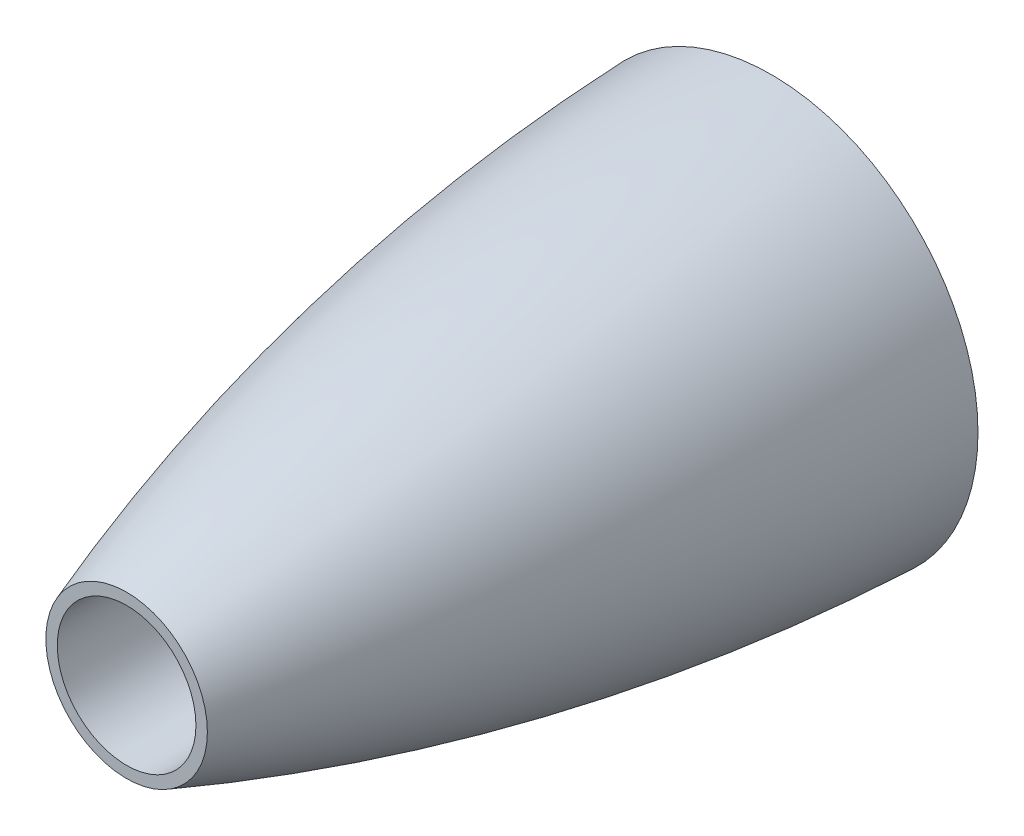
ISO-10303-21;
HEADER;
FILE_DESCRIPTION(('STEP AP214'),'2;1');
FILE_NAME('part.step','',(''),(''),'','','');
FILE_SCHEMA(('AUTOMOTIVE_DESIGN { 1 0 10303 214 1 1 1 1 }'));
ENDSEC;
DATA;
#1=APPLICATION_CONTEXT('core data for automotive mechanical design processes');
#2=APPLICATION_PROTOCOL_DEFINITION('international standard','automotive_design',2000,#1);
#3=PRODUCT_CONTEXT('',#1,'mechanical');
#4=PRODUCT('Part','Part','',(#3));
#5=PRODUCT_RELATED_PRODUCT_CATEGORY('part','',(#4));
#6=PRODUCT_DEFINITION_FORMATION('','',#4);
#7=PRODUCT_DEFINITION_CONTEXT('part definition',#1,'design');
#8=PRODUCT_DEFINITION('design','',#6,#7);
#9=PRODUCT_DEFINITION_SHAPE('','',#8);
#10=(LENGTH_UNIT() NAMED_UNIT(*) SI_UNIT(.MILLI.,.METRE.));
#11=(NAMED_UNIT(*) PLANE_ANGLE_UNIT() SI_UNIT($,.RADIAN.));
#12=(NAMED_UNIT(*) SI_UNIT($,.STERADIAN.) SOLID_ANGLE_UNIT());
#13=UNCERTAINTY_MEASURE_WITH_UNIT(LENGTH_MEASURE(1.E-05),#10,'distance_accuracy_value','');
#14=(GEOMETRIC_REPRESENTATION_CONTEXT(3) GLOBAL_UNCERTAINTY_ASSIGNED_CONTEXT((#13)) GLOBAL_UNIT_ASSIGNED_CONTEXT((#10,
#11,#12)) REPRESENTATION_CONTEXT('',''));
#15=CARTESIAN_POINT('',(0.,0.,0.));
#16=DIRECTION('',(0.,0.,1.));
#17=DIRECTION('',(1.,0.,0.));
#18=AXIS2_PLACEMENT_3D('',#15,#16,#17);
#19=CARTESIAN_POINT('',(0.,0.,-33.1847012280385));
#20=DIRECTION('',(0.,0.,1.));
#21=DIRECTION('',(1.,0.,0.));
#22=AXIS2_PLACEMENT_3D('',#19,#20,#21);
#23=DEGENERATE_TOROIDAL_SURFACE('',#22,87.7251676555519,97.2606154985376,.F.);
#24=CARTESIAN_POINT('',(0.,0.,0.));
#25=DIRECTION('',(0.,0.,1.));
#26=DIRECTION('',(1.,0.,0.));
#27=AXIS2_PLACEMENT_3D('',#24,#25,#26);
#28=CIRCLE('',#27,3.69913399100267);
#29=CARTESIAN_POINT('',(3.69913399100267,0.,0.));
#30=VERTEX_POINT('',#29);
#31=EDGE_CURVE('E58',#30,#30,#28,.T.);
#32=ORIENTED_EDGE('',*,*,#31,.F.);
#33=EDGE_LOOP('',(#32));
#34=FACE_BOUND('',#33,.T.);
#35=CARTESIAN_POINT('',(0.,0.,-29.5275000000013));
#36=DIRECTION('',(0.,0.,1.));
#37=DIRECTION('',(1.,0.,0.));
#38=AXIS2_PLACEMENT_3D('',#35,#36,#37);
#39=CIRCLE('',#38,9.46666433835603);
#40=CARTESIAN_POINT('',(9.46666433835603,0.,-29.5275000000013));
#41=VERTEX_POINT('',#40);
#42=EDGE_CURVE('E10',#41,#41,#39,.T.);
#43=ORIENTED_EDGE('',*,*,#42,.T.);
#44=EDGE_LOOP('',(#43));
#45=FACE_BOUND('',#44,.T.);
#46=ADVANCED_FACE('F30',(#34,#45),#23,.F.);
#47=CARTESIAN_POINT('',(0.,9.46666433835603,-29.5275000000013));
#48=DIRECTION('',(0.,0.,1.));
#49=DIRECTION('',(1.,0.,0.));
#50=AXIS2_PLACEMENT_3D('',#47,#48,#49);
#51=PLANE('',#50);
#52=ORIENTED_EDGE('',*,*,#42,.F.);
#53=EDGE_LOOP('',(#52));
#54=FACE_BOUND('',#53,.T.);
#55=CARTESIAN_POINT('',(0.,0.,-29.5275000000013));
#56=DIRECTION('',(0.,0.,1.));
#57=DIRECTION('',(1.,0.,0.));
#58=AXIS2_PLACEMENT_3D('',#55,#56,#57);
#59=CIRCLE('',#58,5.87346205355848);
#60=CARTESIAN_POINT('',(5.87346205355848,0.,-29.5275000000013));
#61=VERTEX_POINT('',#60);
#62=EDGE_CURVE('E36',#61,#61,#59,.T.);
#63=ORIENTED_EDGE('',*,*,#62,.T.);
#64=EDGE_LOOP('',(#63));
#65=FACE_BOUND('',#64,.T.);
#66=ADVANCED_FACE('F65',(#54,#65),#51,.F.);
#67=CARTESIAN_POINT('',(0.,0.,0.));
#68=DIRECTION('',(0.,0.,1.));
#69=DIRECTION('',(1.,0.,0.));
#70=AXIS2_PLACEMENT_3D('',#67,#68,#69);
#71=CYLINDRICAL_SURFACE('',#70,5.87346205355848);
#72=ORIENTED_EDGE('',*,*,#62,.F.);
#73=EDGE_LOOP('',(#72));
#74=FACE_BOUND('',#73,.T.);
#75=CARTESIAN_POINT('',(0.,0.,-30.1625000000013));
#76=DIRECTION('',(0.,0.,1.));
#77=DIRECTION('',(1.,0.,0.));
#78=AXIS2_PLACEMENT_3D('',#75,#76,#77);
#79=CIRCLE('',#78,5.87346205355848);
#80=CARTESIAN_POINT('',(5.87346205355848,0.,-30.1625000000013));
#81=VERTEX_POINT('',#80);
#82=EDGE_CURVE('E40',#81,#81,#79,.T.);
#83=ORIENTED_EDGE('',*,*,#82,.T.);
#84=EDGE_LOOP('',(#83));
#85=FACE_BOUND('',#84,.T.);
#86=ADVANCED_FACE('F69',(#74,#85),#71,.T.);
#87=CARTESIAN_POINT('',(0.,5.87346205355848,-30.1625000000013));
#88=DIRECTION('',(0.,0.,1.));
#89=DIRECTION('',(1.,0.,0.));
#90=AXIS2_PLACEMENT_3D('',#87,#88,#89);
#91=PLANE('',#90);
#92=ORIENTED_EDGE('',*,*,#82,.F.);
#93=EDGE_LOOP('',(#92));
#94=FACE_BOUND('',#93,.T.);
#95=CARTESIAN_POINT('',(0.,0.,-30.1625000000013));
#96=DIRECTION('',(0.,0.,1.));
#97=DIRECTION('',(1.,0.,0.));
#98=AXIS2_PLACEMENT_3D('',#95,#96,#97);
#99=CIRCLE('',#98,4.66720461323717);
#100=CARTESIAN_POINT('',(4.66720461323717,0.,-30.1625000000013));
#101=VERTEX_POINT('',#100);
#102=EDGE_CURVE('E44',#101,#101,#99,.T.);
#103=ORIENTED_EDGE('',*,*,#102,.T.);
#104=EDGE_LOOP('',(#103));
#105=FACE_BOUND('',#104,.T.);
#106=ADVANCED_FACE('F74',(#94,#105),#91,.F.);
#107=CARTESIAN_POINT('',(0.,0.,-4.78790000003764));
#108=DIRECTION('',(0.,0.,-1.));
#109=DIRECTION('',(-1.,0.,0.));
#110=AXIS2_PLACEMENT_3D('',#107,#108,#109);
#111=CONICAL_SURFACE('',#110,2.44721477173542,0.0872664625997172);
#112=ORIENTED_EDGE('',*,*,#102,.F.);
#113=EDGE_LOOP('',(#112));
#114=FACE_BOUND('',#113,.T.);
#115=CARTESIAN_POINT('',(0.,0.,-4.78790000003764));
#116=DIRECTION('',(0.,0.,1.));
#117=DIRECTION('',(1.,0.,0.));
#118=AXIS2_PLACEMENT_3D('',#115,#116,#117);
#119=CIRCLE('',#118,2.44721477173542);
#120=CARTESIAN_POINT('',(2.44721477173542,0.,-4.78790000003764));
#121=VERTEX_POINT('',#120);
#122=EDGE_CURVE('E49',#121,#121,#119,.T.);
#123=ORIENTED_EDGE('',*,*,#122,.T.);
#124=EDGE_LOOP('',(#123));
#125=FACE_BOUND('',#124,.T.);
#126=ADVANCED_FACE('F80',(#114,#125),#111,.F.);
#127=CARTESIAN_POINT('',(0.,3.16563958196721,-4.78790000003764));
#128=DIRECTION('',(0.,0.,-1.));
#129=DIRECTION('',(-1.,0.,0.));
#130=AXIS2_PLACEMENT_3D('',#127,#128,#129);
#131=PLANE('',#130);
#132=ORIENTED_EDGE('',*,*,#122,.F.);
#133=EDGE_LOOP('',(#132));
#134=FACE_BOUND('',#133,.T.);
#135=CARTESIAN_POINT('',(0.,0.,-4.78790000003764));
#136=DIRECTION('',(0.,0.,1.));
#137=DIRECTION('',(1.,0.,0.));
#138=AXIS2_PLACEMENT_3D('',#135,#136,#137);
#139=CIRCLE('',#138,3.16563958196721);
#140=CARTESIAN_POINT('',(3.16563958196721,0.,-4.78790000003764));
#141=VERTEX_POINT('',#140);
#142=EDGE_CURVE('E52',#141,#141,#139,.T.);
#143=ORIENTED_EDGE('',*,*,#142,.T.);
#144=EDGE_LOOP('',(#143));
#145=FACE_BOUND('',#144,.T.);
#146=ADVANCED_FACE('F84',(#134,#145),#131,.F.);
#147=CARTESIAN_POINT('',(0.,0.,0.));
#148=DIRECTION('',(0.,0.,1.));
#149=DIRECTION('',(1.,0.,0.));
#150=AXIS2_PLACEMENT_3D('',#147,#148,#149);
#151=CONICAL_SURFACE('',#150,3.175,0.00195501286729072);
#152=ORIENTED_EDGE('',*,*,#142,.F.);
#153=EDGE_LOOP('',(#152));
#154=FACE_BOUND('',#153,.T.);
#155=CARTESIAN_POINT('',(0.,0.,0.));
#156=DIRECTION('',(0.,0.,1.));
#157=DIRECTION('',(1.,0.,0.));
#158=AXIS2_PLACEMENT_3D('',#155,#156,#157);
#159=CIRCLE('',#158,3.175);
#160=CARTESIAN_POINT('',(3.175,0.,0.));
#161=VERTEX_POINT('',#160);
#162=EDGE_CURVE('E55',#161,#161,#159,.T.);
#163=ORIENTED_EDGE('',*,*,#162,.T.);
#164=EDGE_LOOP('',(#163));
#165=FACE_BOUND('',#164,.T.);
#166=ADVANCED_FACE('F88',(#154,#165),#151,.F.);
#167=CARTESIAN_POINT('',(0.,3.69913399100267,0.));
#168=DIRECTION('',(0.,0.,-1.));
#169=DIRECTION('',(-1.,0.,0.));
#170=AXIS2_PLACEMENT_3D('',#167,#168,#169);
#171=PLANE('',#170);
#172=ORIENTED_EDGE('',*,*,#162,.F.);
#173=EDGE_LOOP('',(#172));
#174=FACE_BOUND('',#173,.T.);
#175=ORIENTED_EDGE('',*,*,#31,.T.);
#176=EDGE_LOOP('',(#175));
#177=FACE_BOUND('',#176,.T.);
#178=ADVANCED_FACE('F62',(#174,#177),#171,.F.);
#179=CLOSED_SHELL('',(#46,#66,#86,#106,#126,#146,#166,#178));
#180=MANIFOLD_SOLID_BREP('B2',#179);
#181=ADVANCED_BREP_SHAPE_REPRESENTATION('',(#18,#180),#14);
#182=SHAPE_DEFINITION_REPRESENTATION(#9,#181);
ENDSEC;
END-ISO-10303-21;
